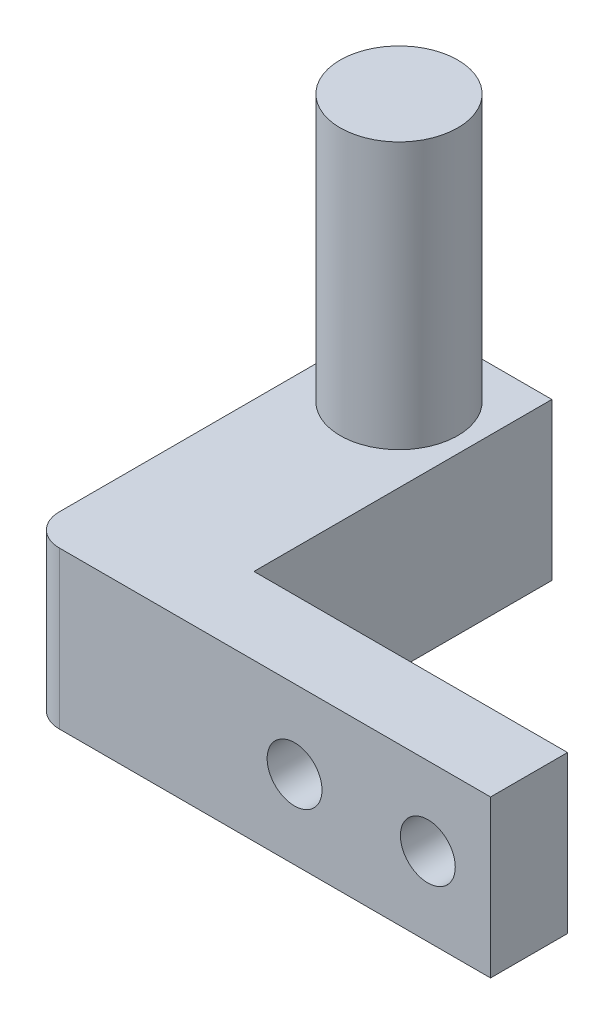
ISO-10303-21;
HEADER;
FILE_DESCRIPTION(('STEP AP214'),'2;1');
FILE_NAME('part.step','',(''),(''),'','','');
FILE_SCHEMA(('AUTOMOTIVE_DESIGN { 1 0 10303 214 1 1 1 1 }'));
ENDSEC;
DATA;
#1=APPLICATION_CONTEXT('core data for automotive mechanical design processes');
#2=APPLICATION_PROTOCOL_DEFINITION('international standard','automotive_design',2000,#1);
#3=PRODUCT_CONTEXT('',#1,'mechanical');
#4=PRODUCT('Part','Part','',(#3));
#5=PRODUCT_RELATED_PRODUCT_CATEGORY('part','',(#4));
#6=PRODUCT_DEFINITION_FORMATION('','',#4);
#7=PRODUCT_DEFINITION_CONTEXT('part definition',#1,'design');
#8=PRODUCT_DEFINITION('design','',#6,#7);
#9=PRODUCT_DEFINITION_SHAPE('','',#8);
#10=(LENGTH_UNIT() NAMED_UNIT(*) SI_UNIT(.MILLI.,.METRE.));
#11=(NAMED_UNIT(*) PLANE_ANGLE_UNIT() SI_UNIT($,.RADIAN.));
#12=(NAMED_UNIT(*) SI_UNIT($,.STERADIAN.) SOLID_ANGLE_UNIT());
#13=UNCERTAINTY_MEASURE_WITH_UNIT(LENGTH_MEASURE(1.E-05),#10,'distance_accuracy_value','');
#14=(GEOMETRIC_REPRESENTATION_CONTEXT(3) GLOBAL_UNCERTAINTY_ASSIGNED_CONTEXT((#13)) GLOBAL_UNIT_ASSIGNED_CONTEXT((#10,
#11,#12)) REPRESENTATION_CONTEXT('',''));
#15=CARTESIAN_POINT('',(0.,0.,0.));
#16=DIRECTION('',(0.,0.,1.));
#17=DIRECTION('',(1.,0.,0.));
#18=AXIS2_PLACEMENT_3D('',#15,#16,#17);
#19=CARTESIAN_POINT('',(8.5,0.,0.));
#20=DIRECTION('',(-1.,0.,0.));
#21=DIRECTION('',(0.,0.,1.));
#22=AXIS2_PLACEMENT_3D('',#19,#20,#21);
#23=PLANE('',#22);
#24=DIRECTION('',(0.,0.,1.));
#25=VECTOR('',#24,1.);
#26=CARTESIAN_POINT('',(8.5,10.,0.));
#27=LINE('',#26,#25);
#28=CARTESIAN_POINT('',(8.5,10.,0.));
#29=VERTEX_POINT('',#28);
#30=CARTESIAN_POINT('',(8.5,10.,19.));
#31=VERTEX_POINT('',#30);
#32=EDGE_CURVE('E136',#29,#31,#27,.T.);
#33=ORIENTED_EDGE('',*,*,#32,.T.);
#34=DIRECTION('',(0.,-1.,0.));
#35=VECTOR('',#34,1.);
#36=CARTESIAN_POINT('',(8.5,27.,19.));
#37=LINE('',#36,#35);
#38=CARTESIAN_POINT('',(8.5,0.,19.));
#39=VERTEX_POINT('',#38);
#40=EDGE_CURVE('E122',#31,#39,#37,.T.);
#41=ORIENTED_EDGE('',*,*,#40,.T.);
#42=DIRECTION('',(0.,0.,1.));
#43=VECTOR('',#42,1.);
#44=CARTESIAN_POINT('',(8.5,0.,0.));
#45=LINE('',#44,#43);
#46=CARTESIAN_POINT('',(8.5,0.,0.));
#47=VERTEX_POINT('',#46);
#48=EDGE_CURVE('E137',#47,#39,#45,.T.);
#49=ORIENTED_EDGE('',*,*,#48,.F.);
#50=DIRECTION('',(0.,1.,0.));
#51=VECTOR('',#50,1.);
#52=CARTESIAN_POINT('',(8.5,0.,0.));
#53=LINE('',#52,#51);
#54=EDGE_CURVE('E139',#47,#29,#53,.T.);
#55=ORIENTED_EDGE('',*,*,#54,.T.);
#56=EDGE_LOOP('',(#33,#41,#49,#55));
#57=FACE_BOUND('',#56,.T.);
#58=ADVANCED_FACE('F33',(#57),#23,.F.);
#59=CARTESIAN_POINT('',(0.,0.,10.));
#60=DIRECTION('',(0.,1.,0.));
#61=DIRECTION('',(0.,0.,1.));
#62=AXIS2_PLACEMENT_3D('',#59,#60,#61);
#63=PLANE('',#62);
#64=DIRECTION('',(1.,0.,0.));
#65=VECTOR('',#64,1.);
#66=CARTESIAN_POINT('',(-1.,0.,23.91));
#67=LINE('',#66,#65);
#68=CARTESIAN_POINT('',(1.,0.,23.91));
#69=VERTEX_POINT('',#68);
#70=CARTESIAN_POINT('',(28.5,0.,23.91));
#71=VERTEX_POINT('',#70);
#72=EDGE_CURVE('E90',#69,#71,#67,.T.);
#73=ORIENTED_EDGE('',*,*,#72,.F.);
#74=CARTESIAN_POINT('',(1.,0.,21.91));
#75=DIRECTION('',(0.,1.,0.));
#76=DIRECTION('',(0.,0.,1.));
#77=AXIS2_PLACEMENT_3D('',#74,#75,#76);
#78=CIRCLE('',#77,2.);
#79=CARTESIAN_POINT('',(-0.999999999999997,0.,21.91));
#80=VERTEX_POINT('',#79);
#81=EDGE_CURVE('E55',#69,#80,#78,.F.);
#82=ORIENTED_EDGE('',*,*,#81,.T.);
#83=DIRECTION('',(0.,0.,-1.));
#84=VECTOR('',#83,1.);
#85=CARTESIAN_POINT('',(-1.,0.,0.));
#86=LINE('',#85,#84);
#87=CARTESIAN_POINT('',(-1.,0.,0.));
#88=VERTEX_POINT('',#87);
#89=EDGE_CURVE('E130',#80,#88,#86,.T.);
#90=ORIENTED_EDGE('',*,*,#89,.T.);
#91=DIRECTION('',(1.,0.,0.));
#92=VECTOR('',#91,1.);
#93=CARTESIAN_POINT('',(0.,0.,0.));
#94=LINE('',#93,#92);
#95=EDGE_CURVE('E145',#88,#47,#94,.T.);
#96=ORIENTED_EDGE('',*,*,#95,.T.);
#97=ORIENTED_EDGE('',*,*,#48,.T.);
#98=DIRECTION('',(-1.,0.,0.));
#99=VECTOR('',#98,1.);
#100=CARTESIAN_POINT('',(8.5,0.,19.));
#101=LINE('',#100,#99);
#102=CARTESIAN_POINT('',(28.5,0.,19.));
#103=VERTEX_POINT('',#102);
#104=EDGE_CURVE('E107',#103,#39,#101,.T.);
#105=ORIENTED_EDGE('',*,*,#104,.F.);
#106=DIRECTION('',(0.,0.,-1.));
#107=VECTOR('',#106,1.);
#108=CARTESIAN_POINT('',(28.5,0.,22.91));
#109=LINE('',#108,#107);
#110=EDGE_CURVE('E104',#71,#103,#109,.T.);
#111=ORIENTED_EDGE('',*,*,#110,.F.);
#112=EDGE_LOOP('',(#73,#82,#90,#96,#97,#105,#111));
#113=FACE_BOUND('',#112,.T.);
#114=ADVANCED_FACE('F105',(#113),#63,.F.);
#115=CARTESIAN_POINT('',(0.,10.,10.));
#116=DIRECTION('',(0.,-1.,0.));
#117=DIRECTION('',(0.,0.,-1.));
#118=AXIS2_PLACEMENT_3D('',#115,#116,#117);
#119=PLANE('',#118);
#120=CARTESIAN_POINT('',(3.75,10.,5.));
#121=DIRECTION('',(0.,-1.,0.));
#122=DIRECTION('',(0.,0.,-1.));
#123=AXIS2_PLACEMENT_3D('',#120,#121,#122);
#124=CIRCLE('',#123,3.75);
#125=CARTESIAN_POINT('',(3.75,10.,1.25));
#126=VERTEX_POINT('',#125);
#127=EDGE_CURVE('E150',#126,#126,#124,.F.);
#128=ORIENTED_EDGE('',*,*,#127,.F.);
#129=EDGE_LOOP('',(#128));
#130=FACE_BOUND('',#129,.T.);
#131=DIRECTION('',(0.,0.,-1.));
#132=VECTOR('',#131,1.);
#133=CARTESIAN_POINT('',(-1.,10.,0.));
#134=LINE('',#133,#132);
#135=CARTESIAN_POINT('',(-0.999999999999997,10.,21.91));
#136=VERTEX_POINT('',#135);
#137=CARTESIAN_POINT('',(-0.999999999999999,10.,0.));
#138=VERTEX_POINT('',#137);
#139=EDGE_CURVE('E129',#136,#138,#134,.T.);
#140=ORIENTED_EDGE('',*,*,#139,.F.);
#141=CARTESIAN_POINT('',(1.,10.,21.91));
#142=DIRECTION('',(0.,-1.,0.));
#143=DIRECTION('',(0.,0.,-1.));
#144=AXIS2_PLACEMENT_3D('',#141,#142,#143);
#145=CIRCLE('',#144,2.);
#146=CARTESIAN_POINT('',(1.,10.,23.91));
#147=VERTEX_POINT('',#146);
#148=EDGE_CURVE('E11',#136,#147,#145,.F.);
#149=ORIENTED_EDGE('',*,*,#148,.T.);
#150=DIRECTION('',(-1.,0.,0.));
#151=VECTOR('',#150,1.);
#152=CARTESIAN_POINT('',(-1.,10.,23.91));
#153=LINE('',#152,#151);
#154=CARTESIAN_POINT('',(28.5,10.,23.91));
#155=VERTEX_POINT('',#154);
#156=EDGE_CURVE('E115',#155,#147,#153,.T.);
#157=ORIENTED_EDGE('',*,*,#156,.F.);
#158=DIRECTION('',(0.,0.,1.));
#159=VECTOR('',#158,1.);
#160=CARTESIAN_POINT('',(28.5,10.,22.91));
#161=LINE('',#160,#159);
#162=CARTESIAN_POINT('',(28.5,10.,19.));
#163=VERTEX_POINT('',#162);
#164=EDGE_CURVE('E110',#163,#155,#161,.T.);
#165=ORIENTED_EDGE('',*,*,#164,.F.);
#166=DIRECTION('',(-1.,0.,0.));
#167=VECTOR('',#166,1.);
#168=CARTESIAN_POINT('',(0.,10.,19.));
#169=LINE('',#168,#167);
#170=EDGE_CURVE('E111',#163,#31,#169,.T.);
#171=ORIENTED_EDGE('',*,*,#170,.T.);
#172=ORIENTED_EDGE('',*,*,#32,.F.);
#173=DIRECTION('',(-1.,0.,0.));
#174=VECTOR('',#173,1.);
#175=CARTESIAN_POINT('',(0.,10.,0.));
#176=LINE('',#175,#174);
#177=EDGE_CURVE('E147',#29,#138,#176,.T.);
#178=ORIENTED_EDGE('',*,*,#177,.T.);
#179=EDGE_LOOP('',(#140,#149,#157,#165,#171,#172,#178));
#180=FACE_BOUND('',#179,.T.);
#181=ADVANCED_FACE('F190',(#130,#180),#119,.F.);
#182=CARTESIAN_POINT('',(0.,0.,0.));
#183=DIRECTION('',(0.,0.,-1.));
#184=DIRECTION('',(-1.,0.,0.));
#185=AXIS2_PLACEMENT_3D('',#182,#183,#184);
#186=PLANE('',#185);
#187=DIRECTION('',(0.,1.,0.));
#188=VECTOR('',#187,1.);
#189=CARTESIAN_POINT('',(-1.,0.,0.));
#190=LINE('',#189,#188);
#191=EDGE_CURVE('E132',#88,#138,#190,.T.);
#192=ORIENTED_EDGE('',*,*,#191,.T.);
#193=ORIENTED_EDGE('',*,*,#177,.F.);
#194=ORIENTED_EDGE('',*,*,#54,.F.);
#195=ORIENTED_EDGE('',*,*,#95,.F.);
#196=EDGE_LOOP('',(#192,#193,#194,#195));
#197=FACE_BOUND('',#196,.T.);
#198=ADVANCED_FACE('F202',(#197),#186,.T.);
#199=CARTESIAN_POINT('',(3.75,27.,5.));
#200=DIRECTION('',(0.,-1.,0.));
#201=DIRECTION('',(0.,0.,-1.));
#202=AXIS2_PLACEMENT_3D('',#199,#200,#201);
#203=CYLINDRICAL_SURFACE('',#202,3.75);
#204=CARTESIAN_POINT('',(3.75,27.,5.));
#205=DIRECTION('',(0.,1.,0.));
#206=DIRECTION('',(0.,0.,1.));
#207=AXIS2_PLACEMENT_3D('',#204,#205,#206);
#208=CIRCLE('',#207,3.75);
#209=CARTESIAN_POINT('',(3.75,27.,8.75));
#210=VERTEX_POINT('',#209);
#211=EDGE_CURVE('E142',#210,#210,#208,.T.);
#212=ORIENTED_EDGE('',*,*,#211,.F.);
#213=EDGE_LOOP('',(#212));
#214=FACE_BOUND('',#213,.T.);
#215=ORIENTED_EDGE('',*,*,#127,.T.);
#216=EDGE_LOOP('',(#215));
#217=FACE_BOUND('',#216,.T.);
#218=ADVANCED_FACE('F198',(#214,#217),#203,.T.);
#219=CARTESIAN_POINT('',(3.75,27.,5.));
#220=DIRECTION('',(0.,1.,0.));
#221=DIRECTION('',(0.,0.,1.));
#222=AXIS2_PLACEMENT_3D('',#219,#220,#221);
#223=PLANE('',#222);
#224=ORIENTED_EDGE('',*,*,#211,.T.);
#225=EDGE_LOOP('',(#224));
#226=FACE_BOUND('',#225,.T.);
#227=ADVANCED_FACE('F195',(#226),#223,.T.);
#228=CARTESIAN_POINT('',(-1.,0.,0.));
#229=DIRECTION('',(1.,0.,0.));
#230=DIRECTION('',(0.,0.,-1.));
#231=AXIS2_PLACEMENT_3D('',#228,#229,#230);
#232=PLANE('',#231);
#233=ORIENTED_EDGE('',*,*,#89,.F.);
#234=DIRECTION('',(0.,-1.,0.));
#235=VECTOR('',#234,1.);
#236=CARTESIAN_POINT('',(-0.999999999999997,10.,21.91));
#237=LINE('',#236,#235);
#238=EDGE_CURVE('E41',#80,#136,#237,.F.);
#239=ORIENTED_EDGE('',*,*,#238,.T.);
#240=ORIENTED_EDGE('',*,*,#139,.T.);
#241=ORIENTED_EDGE('',*,*,#191,.F.);
#242=EDGE_LOOP('',(#233,#239,#240,#241));
#243=FACE_BOUND('',#242,.T.);
#244=ADVANCED_FACE('F193',(#243),#232,.F.);
#245=CARTESIAN_POINT('',(28.5,0.,0.));
#246=DIRECTION('',(1.,0.,0.));
#247=DIRECTION('',(0.,0.,-1.));
#248=AXIS2_PLACEMENT_3D('',#245,#246,#247);
#249=PLANE('',#248);
#250=DIRECTION('',(0.,-1.,0.));
#251=VECTOR('',#250,1.);
#252=CARTESIAN_POINT('',(28.5,0.,19.));
#253=LINE('',#252,#251);
#254=EDGE_CURVE('E153',#163,#103,#253,.T.);
#255=ORIENTED_EDGE('',*,*,#254,.F.);
#256=ORIENTED_EDGE('',*,*,#164,.T.);
#257=DIRECTION('',(0.,1.,0.));
#258=VECTOR('',#257,1.);
#259=CARTESIAN_POINT('',(28.5,10.,23.91));
#260=LINE('',#259,#258);
#261=EDGE_CURVE('E96',#71,#155,#260,.T.);
#262=ORIENTED_EDGE('',*,*,#261,.F.);
#263=ORIENTED_EDGE('',*,*,#110,.T.);
#264=EDGE_LOOP('',(#255,#256,#262,#263));
#265=FACE_BOUND('',#264,.T.);
#266=ADVANCED_FACE('F113',(#265),#249,.T.);
#267=CARTESIAN_POINT('',(8.5,27.,19.));
#268=DIRECTION('',(0.,0.,1.));
#269=DIRECTION('',(1.,0.,0.));
#270=AXIS2_PLACEMENT_3D('',#267,#268,#269);
#271=PLANE('',#270);
#272=CARTESIAN_POINT('',(24.5,5.,19.));
#273=DIRECTION('',(0.,0.,1.));
#274=DIRECTION('',(1.,0.,0.));
#275=AXIS2_PLACEMENT_3D('',#272,#273,#274);
#276=CIRCLE('',#275,1.75);
#277=CARTESIAN_POINT('',(26.25,5.,19.));
#278=VERTEX_POINT('',#277);
#279=EDGE_CURVE('E117',#278,#278,#276,.T.);
#280=ORIENTED_EDGE('',*,*,#279,.T.);
#281=EDGE_LOOP('',(#280));
#282=FACE_BOUND('',#281,.T.);
#283=CARTESIAN_POINT('',(16.,5.,19.));
#284=DIRECTION('',(0.,0.,1.));
#285=DIRECTION('',(1.,0.,0.));
#286=AXIS2_PLACEMENT_3D('',#283,#284,#285);
#287=CIRCLE('',#286,1.75);
#288=CARTESIAN_POINT('',(17.75,5.,19.));
#289=VERTEX_POINT('',#288);
#290=EDGE_CURVE('E123',#289,#289,#287,.T.);
#291=ORIENTED_EDGE('',*,*,#290,.T.);
#292=EDGE_LOOP('',(#291));
#293=FACE_BOUND('',#292,.T.);
#294=ORIENTED_EDGE('',*,*,#254,.T.);
#295=ORIENTED_EDGE('',*,*,#104,.T.);
#296=ORIENTED_EDGE('',*,*,#40,.F.);
#297=ORIENTED_EDGE('',*,*,#170,.F.);
#298=EDGE_LOOP('',(#294,#295,#296,#297));
#299=FACE_BOUND('',#298,.T.);
#300=ADVANCED_FACE('F162',(#282,#293,#299),#271,.F.);
#301=CARTESIAN_POINT('',(16.,5.,0.));
#302=DIRECTION('',(0.,0.,1.));
#303=DIRECTION('',(1.,0.,0.));
#304=AXIS2_PLACEMENT_3D('',#301,#302,#303);
#305=CYLINDRICAL_SURFACE('',#304,1.75);
#306=ORIENTED_EDGE('',*,*,#290,.F.);
#307=EDGE_LOOP('',(#306));
#308=FACE_BOUND('',#307,.T.);
#309=CARTESIAN_POINT('',(16.,5.,23.91));
#310=DIRECTION('',(0.,0.,1.));
#311=DIRECTION('',(1.,0.,0.));
#312=AXIS2_PLACEMENT_3D('',#309,#310,#311);
#313=CIRCLE('',#312,1.75);
#314=CARTESIAN_POINT('',(17.75,5.,23.91));
#315=VERTEX_POINT('',#314);
#316=EDGE_CURVE('E173',#315,#315,#313,.T.);
#317=ORIENTED_EDGE('',*,*,#316,.T.);
#318=EDGE_LOOP('',(#317));
#319=FACE_BOUND('',#318,.T.);
#320=ADVANCED_FACE('F168',(#308,#319),#305,.F.);
#321=CARTESIAN_POINT('',(24.5,5.,0.));
#322=DIRECTION('',(0.,0.,1.));
#323=DIRECTION('',(1.,0.,0.));
#324=AXIS2_PLACEMENT_3D('',#321,#322,#323);
#325=CYLINDRICAL_SURFACE('',#324,1.75);
#326=ORIENTED_EDGE('',*,*,#279,.F.);
#327=EDGE_LOOP('',(#326));
#328=FACE_BOUND('',#327,.T.);
#329=CARTESIAN_POINT('',(24.5,5.,23.91));
#330=DIRECTION('',(0.,0.,1.));
#331=DIRECTION('',(1.,0.,0.));
#332=AXIS2_PLACEMENT_3D('',#329,#330,#331);
#333=CIRCLE('',#332,1.75);
#334=CARTESIAN_POINT('',(26.25,5.,23.91));
#335=VERTEX_POINT('',#334);
#336=EDGE_CURVE('E100',#335,#335,#333,.T.);
#337=ORIENTED_EDGE('',*,*,#336,.T.);
#338=EDGE_LOOP('',(#337));
#339=FACE_BOUND('',#338,.T.);
#340=ADVANCED_FACE('F165',(#328,#339),#325,.F.);
#341=CARTESIAN_POINT('',(0.,0.,23.91));
#342=DIRECTION('',(0.,0.,1.));
#343=DIRECTION('',(1.,0.,0.));
#344=AXIS2_PLACEMENT_3D('',#341,#342,#343);
#345=PLANE('',#344);
#346=ORIENTED_EDGE('',*,*,#336,.F.);
#347=EDGE_LOOP('',(#346));
#348=FACE_BOUND('',#347,.T.);
#349=ORIENTED_EDGE('',*,*,#156,.T.);
#350=DIRECTION('',(0.,-1.,0.));
#351=VECTOR('',#350,1.);
#352=CARTESIAN_POINT('',(1.,0.,23.91));
#353=LINE('',#352,#351);
#354=EDGE_CURVE('E99',#147,#69,#353,.T.);
#355=ORIENTED_EDGE('',*,*,#354,.T.);
#356=ORIENTED_EDGE('',*,*,#72,.T.);
#357=ORIENTED_EDGE('',*,*,#261,.T.);
#358=EDGE_LOOP('',(#349,#355,#356,#357));
#359=FACE_BOUND('',#358,.T.);
#360=ORIENTED_EDGE('',*,*,#316,.F.);
#361=EDGE_LOOP('',(#360));
#362=FACE_BOUND('',#361,.T.);
#363=ADVANCED_FACE('F93',(#348,#359,#362),#345,.T.);
#364=CARTESIAN_POINT('',(1.,0.,21.91));
#365=DIRECTION('',(0.,1.,0.));
#366=DIRECTION('',(0.,0.,1.));
#367=AXIS2_PLACEMENT_3D('',#364,#365,#366);
#368=CYLINDRICAL_SURFACE('',#367,2.);
#369=ORIENTED_EDGE('',*,*,#148,.F.);
#370=ORIENTED_EDGE('',*,*,#238,.F.);
#371=ORIENTED_EDGE('',*,*,#81,.F.);
#372=ORIENTED_EDGE('',*,*,#354,.F.);
#373=EDGE_LOOP('',(#369,#370,#371,#372));
#374=FACE_BOUND('',#373,.T.);
#375=ADVANCED_FACE('F35',(#374),#368,.T.);
#376=CLOSED_SHELL('',(#58,#114,#181,#198,#218,#227,#244,#266,#300,#320,#340,#363,#375));
#377=MANIFOLD_SOLID_BREP('B2',#376);
#378=ADVANCED_BREP_SHAPE_REPRESENTATION('',(#18,#377),#14);
#379=SHAPE_DEFINITION_REPRESENTATION(#9,#378);
ENDSEC;
END-ISO-10303-21;
